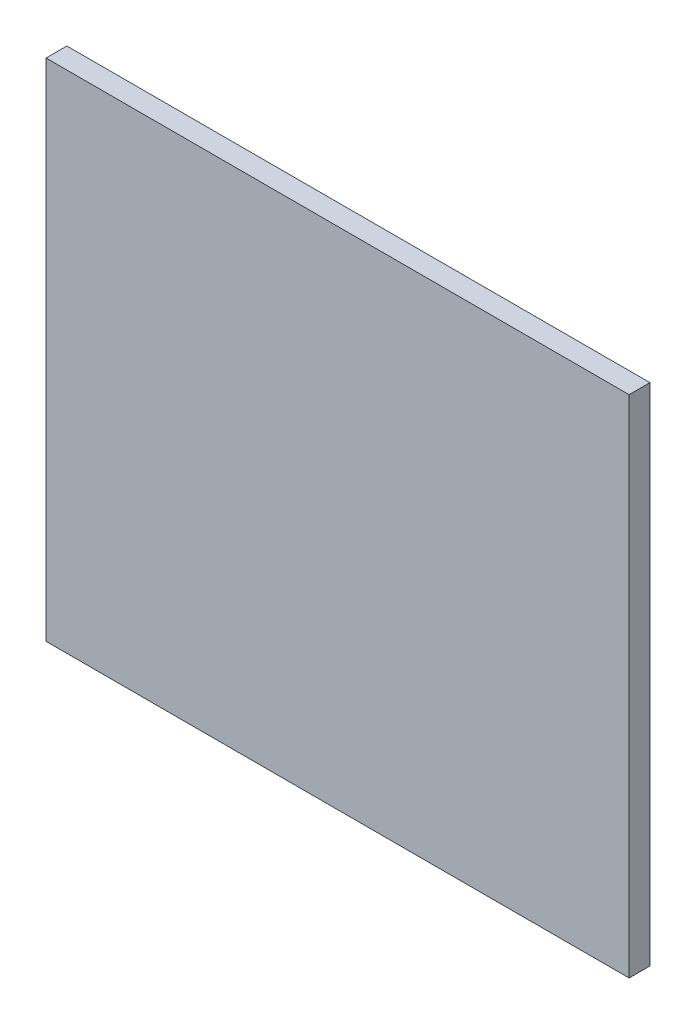
ISO-10303-21;
HEADER;
FILE_DESCRIPTION(('STEP AP214'),'2;1');
FILE_NAME('part.step','',(''),(''),'','','');
FILE_SCHEMA(('AUTOMOTIVE_DESIGN { 1 0 10303 214 1 1 1 1 }'));
ENDSEC;
DATA;
#1=APPLICATION_CONTEXT('core data for automotive mechanical design processes');
#2=APPLICATION_PROTOCOL_DEFINITION('international standard','automotive_design',2000,#1);
#3=PRODUCT_CONTEXT('',#1,'mechanical');
#4=PRODUCT('Part','Part','',(#3));
#5=PRODUCT_RELATED_PRODUCT_CATEGORY('part','',(#4));
#6=PRODUCT_DEFINITION_FORMATION('','',#4);
#7=PRODUCT_DEFINITION_CONTEXT('part definition',#1,'design');
#8=PRODUCT_DEFINITION('design','',#6,#7);
#9=PRODUCT_DEFINITION_SHAPE('','',#8);
#10=(LENGTH_UNIT() NAMED_UNIT(*) SI_UNIT(.MILLI.,.METRE.));
#11=(NAMED_UNIT(*) PLANE_ANGLE_UNIT() SI_UNIT($,.RADIAN.));
#12=(NAMED_UNIT(*) SI_UNIT($,.STERADIAN.) SOLID_ANGLE_UNIT());
#13=UNCERTAINTY_MEASURE_WITH_UNIT(LENGTH_MEASURE(1.E-05),#10,'distance_accuracy_value','');
#14=(GEOMETRIC_REPRESENTATION_CONTEXT(3) GLOBAL_UNCERTAINTY_ASSIGNED_CONTEXT((#13)) GLOBAL_UNIT_ASSIGNED_CONTEXT((#10,
#11,#12)) REPRESENTATION_CONTEXT('',''));
#15=CARTESIAN_POINT('',(0.,0.,0.));
#16=DIRECTION('',(0.,0.,1.));
#17=DIRECTION('',(1.,0.,0.));
#18=AXIS2_PLACEMENT_3D('',#15,#16,#17);
#19=CARTESIAN_POINT('',(0.,0.,12.7));
#20=DIRECTION('',(1.,0.,0.));
#21=DIRECTION('',(0.,0.,-1.));
#22=AXIS2_PLACEMENT_3D('',#19,#20,#21);
#23=PLANE('',#22);
#24=DIRECTION('',(0.,-1.,0.));
#25=VECTOR('',#24,1.);
#26=CARTESIAN_POINT('',(0.,0.,0.));
#27=LINE('',#26,#25);
#28=CARTESIAN_POINT('',(0.,308.102,0.));
#29=VERTEX_POINT('',#28);
#30=CARTESIAN_POINT('',(0.,0.,0.));
#31=VERTEX_POINT('',#30);
#32=EDGE_CURVE('E113',#29,#31,#27,.T.);
#33=ORIENTED_EDGE('',*,*,#32,.T.);
#34=DIRECTION('',(0.,0.,-1.));
#35=VECTOR('',#34,1.);
#36=CARTESIAN_POINT('',(0.,0.,12.7));
#37=LINE('',#36,#35);
#38=CARTESIAN_POINT('',(0.,0.,12.7));
#39=VERTEX_POINT('',#38);
#40=EDGE_CURVE('E11',#39,#31,#37,.T.);
#41=ORIENTED_EDGE('',*,*,#40,.F.);
#42=DIRECTION('',(0.,-1.,0.));
#43=VECTOR('',#42,1.);
#44=CARTESIAN_POINT('',(0.,0.,12.7));
#45=LINE('',#44,#43);
#46=CARTESIAN_POINT('',(0.,308.102,12.7));
#47=VERTEX_POINT('',#46);
#48=EDGE_CURVE('E97',#47,#39,#45,.T.);
#49=ORIENTED_EDGE('',*,*,#48,.F.);
#50=DIRECTION('',(0.,0.,-1.));
#51=VECTOR('',#50,1.);
#52=CARTESIAN_POINT('',(0.,308.102,12.7));
#53=LINE('',#52,#51);
#54=EDGE_CURVE('E109',#47,#29,#53,.T.);
#55=ORIENTED_EDGE('',*,*,#54,.T.);
#56=EDGE_LOOP('',(#33,#41,#49,#55));
#57=FACE_BOUND('',#56,.T.);
#58=ADVANCED_FACE('F45',(#57),#23,.F.);
#59=CARTESIAN_POINT('',(0.,0.,12.7));
#60=DIRECTION('',(0.,1.,0.));
#61=DIRECTION('',(0.,0.,1.));
#62=AXIS2_PLACEMENT_3D('',#59,#60,#61);
#63=PLANE('',#62);
#64=DIRECTION('',(1.,0.,0.));
#65=VECTOR('',#64,1.);
#66=CARTESIAN_POINT('',(0.,0.,0.));
#67=LINE('',#66,#65);
#68=CARTESIAN_POINT('',(355.6,0.,0.));
#69=VERTEX_POINT('',#68);
#70=EDGE_CURVE('E102',#31,#69,#67,.T.);
#71=ORIENTED_EDGE('',*,*,#70,.T.);
#72=DIRECTION('',(0.,0.,-1.));
#73=VECTOR('',#72,1.);
#74=CARTESIAN_POINT('',(355.6,0.,12.7));
#75=LINE('',#74,#73);
#76=CARTESIAN_POINT('',(355.6,0.,12.7));
#77=VERTEX_POINT('',#76);
#78=EDGE_CURVE('E54',#77,#69,#75,.T.);
#79=ORIENTED_EDGE('',*,*,#78,.F.);
#80=DIRECTION('',(1.,0.,0.));
#81=VECTOR('',#80,1.);
#82=CARTESIAN_POINT('',(0.,0.,12.7));
#83=LINE('',#82,#81);
#84=EDGE_CURVE('E92',#39,#77,#83,.T.);
#85=ORIENTED_EDGE('',*,*,#84,.F.);
#86=ORIENTED_EDGE('',*,*,#40,.T.);
#87=EDGE_LOOP('',(#71,#79,#85,#86));
#88=FACE_BOUND('',#87,.T.);
#89=ADVANCED_FACE('F101',(#88),#63,.F.);
#90=CARTESIAN_POINT('',(355.6,0.,12.7));
#91=DIRECTION('',(-1.,0.,0.));
#92=DIRECTION('',(0.,-1.,0.));
#93=AXIS2_PLACEMENT_3D('',#90,#91,#92);
#94=PLANE('',#93);
#95=DIRECTION('',(0.,1.,0.));
#96=VECTOR('',#95,1.);
#97=CARTESIAN_POINT('',(355.6,0.,0.));
#98=LINE('',#97,#96);
#99=CARTESIAN_POINT('',(355.6,308.102,0.));
#100=VERTEX_POINT('',#99);
#101=EDGE_CURVE('E79',#69,#100,#98,.T.);
#102=ORIENTED_EDGE('',*,*,#101,.T.);
#103=DIRECTION('',(0.,0.,-1.));
#104=VECTOR('',#103,1.);
#105=CARTESIAN_POINT('',(355.6,308.102,12.7));
#106=LINE('',#105,#104);
#107=CARTESIAN_POINT('',(355.6,308.102,12.7));
#108=VERTEX_POINT('',#107);
#109=EDGE_CURVE('E104',#108,#100,#106,.T.);
#110=ORIENTED_EDGE('',*,*,#109,.F.);
#111=DIRECTION('',(0.,1.,0.));
#112=VECTOR('',#111,1.);
#113=CARTESIAN_POINT('',(355.6,0.,12.7));
#114=LINE('',#113,#112);
#115=EDGE_CURVE('E95',#77,#108,#114,.T.);
#116=ORIENTED_EDGE('',*,*,#115,.F.);
#117=ORIENTED_EDGE('',*,*,#78,.T.);
#118=EDGE_LOOP('',(#102,#110,#116,#117));
#119=FACE_BOUND('',#118,.T.);
#120=ADVANCED_FACE('F105',(#119),#94,.F.);
#121=CARTESIAN_POINT('',(0.,308.102,12.7));
#122=DIRECTION('',(0.,-1.,0.));
#123=DIRECTION('',(0.,0.,-1.));
#124=AXIS2_PLACEMENT_3D('',#121,#122,#123);
#125=PLANE('',#124);
#126=DIRECTION('',(-1.,0.,0.));
#127=VECTOR('',#126,1.);
#128=CARTESIAN_POINT('',(0.,308.102,0.));
#129=LINE('',#128,#127);
#130=EDGE_CURVE('E85',#100,#29,#129,.T.);
#131=ORIENTED_EDGE('',*,*,#130,.T.);
#132=ORIENTED_EDGE('',*,*,#54,.F.);
#133=DIRECTION('',(-1.,0.,0.));
#134=VECTOR('',#133,1.);
#135=CARTESIAN_POINT('',(0.,308.102,12.7));
#136=LINE('',#135,#134);
#137=EDGE_CURVE('E62',#108,#47,#136,.T.);
#138=ORIENTED_EDGE('',*,*,#137,.F.);
#139=ORIENTED_EDGE('',*,*,#109,.T.);
#140=EDGE_LOOP('',(#131,#132,#138,#139));
#141=FACE_BOUND('',#140,.T.);
#142=ADVANCED_FACE('F126',(#141),#125,.F.);
#143=CARTESIAN_POINT('',(0.,0.,12.7));
#144=DIRECTION('',(0.,0.,-1.));
#145=DIRECTION('',(-1.,0.,0.));
#146=AXIS2_PLACEMENT_3D('',#143,#144,#145);
#147=PLANE('',#146);
#148=ORIENTED_EDGE('',*,*,#48,.T.);
#149=ORIENTED_EDGE('',*,*,#84,.T.);
#150=ORIENTED_EDGE('',*,*,#115,.T.);
#151=ORIENTED_EDGE('',*,*,#137,.T.);
#152=EDGE_LOOP('',(#148,#149,#150,#151));
#153=FACE_BOUND('',#152,.T.);
#154=ADVANCED_FACE('F93',(#153),#147,.F.);
#155=CARTESIAN_POINT('',(0.,0.,0.));
#156=DIRECTION('',(0.,0.,-1.));
#157=DIRECTION('',(-1.,0.,0.));
#158=AXIS2_PLACEMENT_3D('',#155,#156,#157);
#159=PLANE('',#158);
#160=ORIENTED_EDGE('',*,*,#32,.F.);
#161=ORIENTED_EDGE('',*,*,#130,.F.);
#162=ORIENTED_EDGE('',*,*,#101,.F.);
#163=ORIENTED_EDGE('',*,*,#70,.F.);
#164=EDGE_LOOP('',(#160,#161,#162,#163));
#165=FACE_BOUND('',#164,.T.);
#166=ADVANCED_FACE('F129',(#165),#159,.T.);
#167=CLOSED_SHELL('',(#58,#89,#120,#142,#154,#166));
#168=MANIFOLD_SOLID_BREP('B2',#167);
#169=ADVANCED_BREP_SHAPE_REPRESENTATION('',(#18,#168),#14);
#170=SHAPE_DEFINITION_REPRESENTATION(#9,#169);
ENDSEC;
END-ISO-10303-21;
